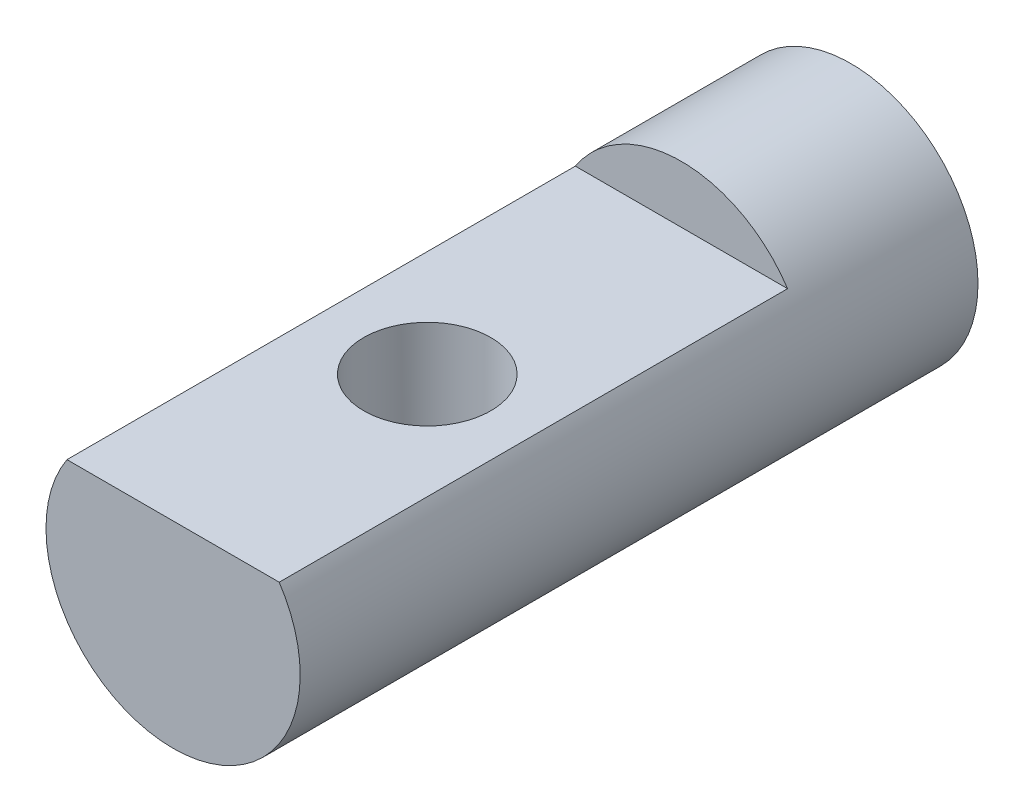
ISO-10303-21;
HEADER;
FILE_DESCRIPTION(('STEP AP214'),'2;1');
FILE_NAME('part.step','',(''),(''),'','','');
FILE_SCHEMA(('AUTOMOTIVE_DESIGN { 1 0 10303 214 1 1 1 1 }'));
ENDSEC;
DATA;
#1=APPLICATION_CONTEXT('core data for automotive mechanical design processes');
#2=APPLICATION_PROTOCOL_DEFINITION('international standard','automotive_design',2000,#1);
#3=PRODUCT_CONTEXT('',#1,'mechanical');
#4=PRODUCT('Part','Part','',(#3));
#5=PRODUCT_RELATED_PRODUCT_CATEGORY('part','',(#4));
#6=PRODUCT_DEFINITION_FORMATION('','',#4);
#7=PRODUCT_DEFINITION_CONTEXT('part definition',#1,'design');
#8=PRODUCT_DEFINITION('design','',#6,#7);
#9=PRODUCT_DEFINITION_SHAPE('','',#8);
#10=(LENGTH_UNIT() NAMED_UNIT(*) SI_UNIT(.MILLI.,.METRE.));
#11=(NAMED_UNIT(*) PLANE_ANGLE_UNIT() SI_UNIT($,.RADIAN.));
#12=(NAMED_UNIT(*) SI_UNIT($,.STERADIAN.) SOLID_ANGLE_UNIT());
#13=UNCERTAINTY_MEASURE_WITH_UNIT(LENGTH_MEASURE(1.E-05),#10,'distance_accuracy_value','');
#14=(GEOMETRIC_REPRESENTATION_CONTEXT(3) GLOBAL_UNCERTAINTY_ASSIGNED_CONTEXT((#13)) GLOBAL_UNIT_ASSIGNED_CONTEXT((#10,
#11,#12)) REPRESENTATION_CONTEXT('',''));
#15=CARTESIAN_POINT('',(0.,0.,0.));
#16=DIRECTION('',(0.,0.,1.));
#17=DIRECTION('',(1.,0.,0.));
#18=AXIS2_PLACEMENT_3D('',#15,#16,#17);
#19=CARTESIAN_POINT('',(0.,0.,16.));
#20=DIRECTION('',(0.,0.,-1.));
#21=DIRECTION('',(-1.,0.,0.));
#22=AXIS2_PLACEMENT_3D('',#19,#20,#21);
#23=CYLINDRICAL_SURFACE('',#22,3.);
#24=CARTESIAN_POINT('',(-1.5,-2.59807621135332,10.));
#25=CARTESIAN_POINT('',(-1.4999945446118,-2.59808302092689,10.0781617122929));
#26=CARTESIAN_POINT('',(-1.49384995609982,-2.60165701781635,10.1564221172876));
#27=CARTESIAN_POINT('',(-1.46958481484708,-2.61543549678079,10.3105408970157));
#28=CARTESIAN_POINT('',(-1.45143909683127,-2.62565391083339,10.3863938725651));
#29=CARTESIAN_POINT('',(-1.40414992304972,-2.65124019908098,10.5331774965159));
#30=CARTESIAN_POINT('',(-1.3750649287406,-2.66658065209878,10.6041319787104));
#31=CARTESIAN_POINT('',(-1.30690128806456,-2.70063997225287,10.7401363029951));
#32=CARTESIAN_POINT('',(-1.26782210105366,-2.71935902214097,10.8051858253937));
#33=CARTESIAN_POINT('',(-1.17699981079632,-2.75995303586162,10.9334585928363));
#34=CARTESIAN_POINT('',(-1.12447805421566,-2.7819609545693,10.9960887035103));
#35=CARTESIAN_POINT('',(-1.0098807114217,-2.82557974178558,11.1121125826101));
#36=CARTESIAN_POINT('',(-0.94780038867344,-2.84719040746875,11.1655017438753));
#37=CARTESIAN_POINT('',(-0.810734345121819,-2.88932215429423,11.2650507267215));
#38=CARTESIAN_POINT('',(-0.735160783518863,-2.90967159627259,11.3104806517893));
#39=CARTESIAN_POINT('',(-0.576235539899257,-2.94526134149293,11.3877112798686));
#40=CARTESIAN_POINT('',(-0.492888807207233,-2.96050486775612,11.4195205842058));
#41=CARTESIAN_POINT('',(-0.327067415888966,-2.98320691866356,11.4662569919516));
#42=CARTESIAN_POINT('',(-0.244952685733227,-2.99114220331338,11.4822242895333));
#43=CARTESIAN_POINT('',(-0.0788559430467728,-3.000113757691,11.5002491780126));
#44=CARTESIAN_POINT('',(0.00512490876560717,-3.00115420176885,11.5023151851936));
#45=CARTESIAN_POINT('',(0.164748786635625,-2.99644472874675,11.4928799890445));
#46=CARTESIAN_POINT('',(0.240481798765187,-2.99127743838241,11.4825429767182));
#47=CARTESIAN_POINT('',(0.388970657877483,-2.97561367889621,11.450678734143));
#48=CARTESIAN_POINT('',(0.461726281640888,-2.96511681099591,11.4291506665357));
#49=CARTESIAN_POINT('',(0.60346408735433,-2.93957374931481,11.3753761508653));
#50=CARTESIAN_POINT('',(0.672380135272767,-2.92446662293799,11.3429855302419));
#51=CARTESIAN_POINT('',(0.803965202269992,-2.89106468980031,11.2686048756978));
#52=CARTESIAN_POINT('',(0.866631973257968,-2.87276874236226,11.2266114050465));
#53=CARTESIAN_POINT('',(0.990260491347292,-2.83266591598844,11.1296569727005));
#54=CARTESIAN_POINT('',(1.05050111254404,-2.81069063997263,11.073845457511));
#55=CARTESIAN_POINT('',(1.16115655544667,-2.76681510880217,10.9531154126047));
#56=CARTESIAN_POINT('',(1.21156381736135,-2.74491492398443,10.8881899415889));
#57=CARTESIAN_POINT('',(1.30425800196332,-2.70216234138727,10.7460277113639));
#58=CARTESIAN_POINT('',(1.34582597246708,-2.68146479986061,10.6682709654187));
#59=CARTESIAN_POINT('',(1.41497866950185,-2.64563175417864,10.5055934929615));
#60=CARTESIAN_POINT('',(1.44257798731634,-2.63049045069101,10.4206803504737));
#61=CARTESIAN_POINT('',(1.48077031653756,-2.60916953725551,10.2531782330758));
#62=CARTESIAN_POINT('',(1.49253768317996,-2.60237483772744,10.1709383214347));
#63=CARTESIAN_POINT('',(1.50227541991714,-2.59676879042414,10.0053979877252));
#64=CARTESIAN_POINT('',(1.50025553597254,-2.59795180333967,9.92209835632032));
#65=CARTESIAN_POINT('',(1.48355406501595,-2.60751504810877,9.76651912213191));
#66=CARTESIAN_POINT('',(1.4702817250687,-2.61509381259981,9.69403082333811));
#67=CARTESIAN_POINT('',(1.43354442694866,-2.63541032327011,9.55244832059357));
#68=CARTESIAN_POINT('',(1.41007616793542,-2.64814974007551,9.48335522388009));
#69=CARTESIAN_POINT('',(1.35247138290733,-2.67804333119485,9.34688300364596));
#70=CARTESIAN_POINT('',(1.31789109553909,-2.69537464864595,9.27973147471967));
#71=CARTESIAN_POINT('',(1.23943059602371,-2.73234179245874,9.15179609269151));
#72=CARTESIAN_POINT('',(1.19554560649832,-2.75197880032721,9.09101553473007));
#73=CARTESIAN_POINT('',(1.09325575079828,-2.79431997684504,8.96953184871468));
#74=CARTESIAN_POINT('',(1.03371790847245,-2.81709874731433,8.90980427392351));
#75=CARTESIAN_POINT('',(0.905106743097433,-2.86101352466839,8.80088164300961));
#76=CARTESIAN_POINT('',(0.836030211983022,-2.88214897511564,8.75169014465419));
#77=CARTESIAN_POINT('',(0.687803043838138,-2.92112042536435,8.66413941107485));
#78=CARTESIAN_POINT('',(0.608434646361172,-2.93885462508044,8.62610032268364));
#79=CARTESIAN_POINT('',(0.443283546961625,-2.96825032438951,8.56429314421391));
#80=CARTESIAN_POINT('',(0.357506552088266,-2.97991715514559,8.54051252295054));
#81=CARTESIAN_POINT('',(0.190469523495628,-2.99501262272824,8.50994715373801));
#82=CARTESIAN_POINT('',(0.109517165775688,-2.99909891862287,8.50180318618583));
#83=CARTESIAN_POINT('',(-0.0526889789268034,-3.00063195562697,8.4987351018184));
#84=CARTESIAN_POINT('',(-0.133942650442629,-2.99808102100335,8.50380635721466));
#85=CARTESIAN_POINT('',(-0.288806988475719,-2.98700953256884,8.52612461019343));
#86=CARTESIAN_POINT('',(-0.362568476716894,-2.97889342001985,8.54254727388651));
#87=CARTESIAN_POINT('',(-0.506168928275425,-2.95788140495135,8.58599049895446));
#88=CARTESIAN_POINT('',(-0.576007327433262,-2.94498481699193,8.61301258014018));
#89=CARTESIAN_POINT('',(-0.713135109367326,-2.9148889612218,8.67809057824896));
#90=CARTESIAN_POINT('',(-0.780187714050068,-2.89752925798199,8.71656898481176));
#91=CARTESIAN_POINT('',(-0.907161962721036,-2.86032199712739,8.80293689628857));
#92=CARTESIAN_POINT('',(-0.96708031112236,-2.84047329837541,8.85083072367351));
#93=CARTESIAN_POINT('',(-1.08437100623534,-2.79792915339941,8.96019570853406));
#94=CARTESIAN_POINT('',(-1.14089652680891,-2.77514698517547,9.02254373121579));
#95=CARTESIAN_POINT('',(-1.24299493109201,-2.73094614244278,9.15617608169465));
#96=CARTESIAN_POINT('',(-1.28855812501509,-2.70952868642798,9.22746823130153));
#97=CARTESIAN_POINT('',(-1.36864661967848,-2.66999407957374,9.37995496987143));
#98=CARTESIAN_POINT('',(-1.40277759894141,-2.65200261384405,9.4613912966931));
#99=CARTESIAN_POINT('',(-1.45631806425962,-2.62299234492527,9.62999860650967));
#100=CARTESIAN_POINT('',(-1.47577678676302,-2.61195024221553,9.71714933336903));
#101=CARTESIAN_POINT('',(-1.49155051179662,-2.60293908902686,9.83770803347799));
#102=CARTESIAN_POINT('',(-1.49471415744578,-2.60112193507727,9.87005184159682));
#103=CARTESIAN_POINT('',(-1.49894010763494,-2.59868903831625,9.93492472102337));
#104=CARTESIAN_POINT('',(-1.50000227159981,-2.59807337587664,9.96745380457881));
#105=CARTESIAN_POINT('',(-1.5,-2.59807621135332,10.));
#106=B_SPLINE_CURVE_WITH_KNOTS('',3,(#24,#25,#26,#27,#28,#29,#30,#31,#32,#33,#34,#35,#36,#37,
#38,#39,#40,#41,#42,#43,#44,#45,#46,#47,#48,#49,#50,#51,#52,#53,#54,#55,#56,#57,#58,#59,#60,#61,
#62,#63,#64,#65,#66,#67,#68,#69,#70,#71,#72,#73,#74,#75,#76,#77,#78,#79,#80,#81,#82,#83,#84,#85,
#86,#87,#88,#89,#90,#91,#92,#93,#94,#95,#96,#97,#98,#99,#100,#101,#102,#103,#104,#105),
.UNSPECIFIED.,.T.,.F.,(4,2,2,2,2,2,2,2,2,2,2,2,2,2,2,2,2,2,2,2,2,2,2,2,2,2,2,2,2,2,2,2,2,2,2,2,
2,2,2,2,4),(0.,0.234348183892073,0.469189339237207,0.702792893878329,0.936409088167725,
1.18929346874735,1.44230356626556,1.71236838358145,1.98226240445836,2.23295227451903,
2.4834903552906,2.71224146226807,2.94100968776183,3.1729430209672,3.40495949025408,
3.65890787185336,3.91305072368878,4.18333262594172,4.45333161317557,4.70193436281317,
4.95036139782559,5.17161275136038,5.39293578654094,5.62450944609131,5.85620229330071,
6.1171011537092,6.37808797467303,6.64596272119448,6.91360169713157,7.1566840558423,
7.39968130190957,7.62666637307239,7.85368400268019,8.09041126079208,8.32724745151078,
8.58765362775101,8.84828914267731,9.11716123557907,9.3851269950414,9.48270202777964,
9.58028358741811),.UNSPECIFIED.);
#107=CARTESIAN_POINT('',(-1.5,-2.59807621135332,10.));
#108=VERTEX_POINT('',#107);
#109=EDGE_CURVE('E72',#108,#108,#106,.T.);
#110=ORIENTED_EDGE('',*,*,#109,.T.);
#111=EDGE_LOOP('',(#110));
#112=FACE_BOUND('',#111,.T.);
#113=CARTESIAN_POINT('',(0.,0.,16.));
#114=DIRECTION('',(0.,0.,1.));
#115=DIRECTION('',(1.,0.,0.));
#116=AXIS2_PLACEMENT_3D('',#113,#114,#115);
#117=CIRCLE('',#116,3.);
#118=CARTESIAN_POINT('',(-2.50549396327351,1.65,16.));
#119=VERTEX_POINT('',#118);
#120=CARTESIAN_POINT('',(2.50549396327351,1.65,16.));
#121=VERTEX_POINT('',#120);
#122=EDGE_CURVE('E11',#119,#121,#117,.T.);
#123=ORIENTED_EDGE('',*,*,#122,.F.);
#124=DIRECTION('',(0.,0.,1.));
#125=VECTOR('',#124,1.);
#126=CARTESIAN_POINT('',(-2.50549396327351,1.65,4.));
#127=LINE('',#126,#125);
#128=CARTESIAN_POINT('',(-2.50549396327351,1.65,4.));
#129=VERTEX_POINT('',#128);
#130=EDGE_CURVE('E55',#129,#119,#127,.T.);
#131=ORIENTED_EDGE('',*,*,#130,.F.);
#132=CARTESIAN_POINT('',(0.,0.,4.));
#133=DIRECTION('',(0.,0.,1.));
#134=DIRECTION('',(1.,0.,0.));
#135=AXIS2_PLACEMENT_3D('',#132,#133,#134);
#136=CIRCLE('',#135,3.);
#137=CARTESIAN_POINT('',(2.50549396327351,1.65,4.));
#138=VERTEX_POINT('',#137);
#139=EDGE_CURVE('E71',#138,#129,#136,.T.);
#140=ORIENTED_EDGE('',*,*,#139,.F.);
#141=DIRECTION('',(0.,0.,1.));
#142=VECTOR('',#141,1.);
#143=CARTESIAN_POINT('',(2.50549396327351,1.65,4.));
#144=LINE('',#143,#142);
#145=EDGE_CURVE('E61',#138,#121,#144,.T.);
#146=ORIENTED_EDGE('',*,*,#145,.T.);
#147=EDGE_LOOP('',(#123,#131,#140,#146));
#148=FACE_BOUND('',#147,.T.);
#149=CARTESIAN_POINT('',(0.,0.,0.));
#150=DIRECTION('',(0.,0.,1.));
#151=DIRECTION('',(1.,0.,0.));
#152=AXIS2_PLACEMENT_3D('',#149,#150,#151);
#153=CIRCLE('',#152,3.);
#154=CARTESIAN_POINT('',(3.,0.,0.));
#155=VERTEX_POINT('',#154);
#156=EDGE_CURVE('E43',#155,#155,#153,.T.);
#157=ORIENTED_EDGE('',*,*,#156,.T.);
#158=EDGE_LOOP('',(#157));
#159=FACE_BOUND('',#158,.T.);
#160=ADVANCED_FACE('F39',(#112,#148,#159),#23,.T.);
#161=CARTESIAN_POINT('',(0.,0.,16.));
#162=DIRECTION('',(0.,0.,1.));
#163=DIRECTION('',(1.,0.,0.));
#164=AXIS2_PLACEMENT_3D('',#161,#162,#163);
#165=PLANE('',#164);
#166=DIRECTION('',(1.,0.,0.));
#167=VECTOR('',#166,1.);
#168=CARTESIAN_POINT('',(-2.50549396327351,1.65,16.));
#169=LINE('',#168,#167);
#170=EDGE_CURVE('E66',#119,#121,#169,.T.);
#171=ORIENTED_EDGE('',*,*,#170,.F.);
#172=ORIENTED_EDGE('',*,*,#122,.T.);
#173=EDGE_LOOP('',(#171,#172));
#174=FACE_BOUND('',#173,.T.);
#175=ADVANCED_FACE('F79',(#174),#165,.T.);
#176=CARTESIAN_POINT('',(0.,0.,0.));
#177=DIRECTION('',(0.,0.,1.));
#178=DIRECTION('',(1.,0.,0.));
#179=AXIS2_PLACEMENT_3D('',#176,#177,#178);
#180=PLANE('',#179);
#181=ORIENTED_EDGE('',*,*,#156,.F.);
#182=EDGE_LOOP('',(#181));
#183=FACE_BOUND('',#182,.T.);
#184=ADVANCED_FACE('F81',(#183),#180,.F.);
#185=CARTESIAN_POINT('',(-2.50549396327351,1.65,4.));
#186=DIRECTION('',(0.,-1.,0.));
#187=DIRECTION('',(1.,0.,0.));
#188=AXIS2_PLACEMENT_3D('',#185,#186,#187);
#189=PLANE('',#188);
#190=CARTESIAN_POINT('',(0.,1.65,10.));
#191=DIRECTION('',(0.,1.,0.));
#192=DIRECTION('',(-1.,0.,0.));
#193=AXIS2_PLACEMENT_3D('',#190,#191,#192);
#194=CIRCLE('',#193,1.5);
#195=CARTESIAN_POINT('',(-1.5,1.65,10.));
#196=VERTEX_POINT('',#195);
#197=EDGE_CURVE('E109',#196,#196,#194,.T.);
#198=ORIENTED_EDGE('',*,*,#197,.F.);
#199=EDGE_LOOP('',(#198));
#200=FACE_BOUND('',#199,.T.);
#201=ORIENTED_EDGE('',*,*,#170,.T.);
#202=ORIENTED_EDGE('',*,*,#145,.F.);
#203=DIRECTION('',(1.,0.,0.));
#204=VECTOR('',#203,1.);
#205=CARTESIAN_POINT('',(-2.50549396327351,1.65,4.));
#206=LINE('',#205,#204);
#207=EDGE_CURVE('E112',#129,#138,#206,.T.);
#208=ORIENTED_EDGE('',*,*,#207,.F.);
#209=ORIENTED_EDGE('',*,*,#130,.T.);
#210=EDGE_LOOP('',(#201,#202,#208,#209));
#211=FACE_BOUND('',#210,.T.);
#212=ADVANCED_FACE('F67',(#200,#211),#189,.F.);
#213=CARTESIAN_POINT('',(0.,0.,4.));
#214=DIRECTION('',(0.,0.,1.));
#215=DIRECTION('',(1.,0.,0.));
#216=AXIS2_PLACEMENT_3D('',#213,#214,#215);
#217=PLANE('',#216);
#218=ORIENTED_EDGE('',*,*,#139,.T.);
#219=ORIENTED_EDGE('',*,*,#207,.T.);
#220=EDGE_LOOP('',(#218,#219));
#221=FACE_BOUND('',#220,.T.);
#222=ADVANCED_FACE('F92',(#221),#217,.T.);
#223=CARTESIAN_POINT('',(0.,-10.35,10.));
#224=DIRECTION('',(0.,1.,0.));
#225=DIRECTION('',(-1.,0.,0.));
#226=AXIS2_PLACEMENT_3D('',#223,#224,#225);
#227=CYLINDRICAL_SURFACE('',#226,1.5);
#228=ORIENTED_EDGE('',*,*,#197,.T.);
#229=EDGE_LOOP('',(#228));
#230=FACE_BOUND('',#229,.T.);
#231=ORIENTED_EDGE('',*,*,#109,.F.);
#232=EDGE_LOOP('',(#231));
#233=FACE_BOUND('',#232,.T.);
#234=ADVANCED_FACE('F96',(#230,#233),#227,.F.);
#235=CLOSED_SHELL('',(#160,#175,#184,#212,#222,#234));
#236=MANIFOLD_SOLID_BREP('B2',#235);
#237=ADVANCED_BREP_SHAPE_REPRESENTATION('',(#18,#236),#14);
#238=SHAPE_DEFINITION_REPRESENTATION(#9,#237);
ENDSEC;
END-ISO-10303-21;
